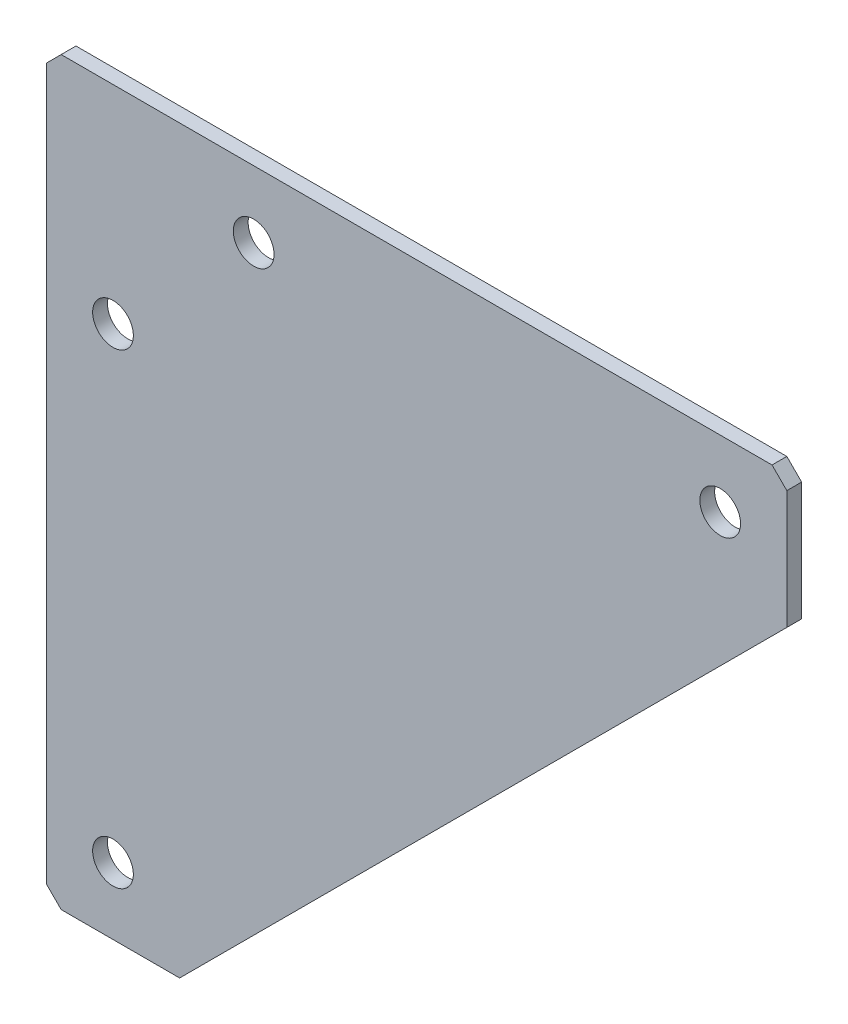
ISO-10303-21;
HEADER;
FILE_DESCRIPTION(('STEP AP214'),'2;1');
FILE_NAME('part.step','',(''),(''),'','','');
FILE_SCHEMA(('AUTOMOTIVE_DESIGN { 1 0 10303 214 1 1 1 1 }'));
ENDSEC;
DATA;
#1=APPLICATION_CONTEXT('core data for automotive mechanical design processes');
#2=APPLICATION_PROTOCOL_DEFINITION('international standard','automotive_design',2000,#1);
#3=PRODUCT_CONTEXT('',#1,'mechanical');
#4=PRODUCT('Part','Part','',(#3));
#5=PRODUCT_RELATED_PRODUCT_CATEGORY('part','',(#4));
#6=PRODUCT_DEFINITION_FORMATION('','',#4);
#7=PRODUCT_DEFINITION_CONTEXT('part definition',#1,'design');
#8=PRODUCT_DEFINITION('design','',#6,#7);
#9=PRODUCT_DEFINITION_SHAPE('','',#8);
#10=(LENGTH_UNIT() NAMED_UNIT(*) SI_UNIT(.MILLI.,.METRE.));
#11=(NAMED_UNIT(*) PLANE_ANGLE_UNIT() SI_UNIT($,.RADIAN.));
#12=(NAMED_UNIT(*) SI_UNIT($,.STERADIAN.) SOLID_ANGLE_UNIT());
#13=UNCERTAINTY_MEASURE_WITH_UNIT(LENGTH_MEASURE(1.E-05),#10,'distance_accuracy_value','');
#14=(GEOMETRIC_REPRESENTATION_CONTEXT(3) GLOBAL_UNCERTAINTY_ASSIGNED_CONTEXT((#13)) GLOBAL_UNIT_ASSIGNED_CONTEXT((#10,
#11,#12)) REPRESENTATION_CONTEXT('',''));
#15=CARTESIAN_POINT('',(0.,0.,0.));
#16=DIRECTION('',(0.,0.,1.));
#17=DIRECTION('',(1.,0.,0.));
#18=AXIS2_PLACEMENT_3D('',#15,#16,#17);
#19=CARTESIAN_POINT('',(2.,100.,-2.));
#20=DIRECTION('',(-0.707106781186548,0.707106781186547,0.));
#21=DIRECTION('',(-0.707106781186547,-0.707106781186548,0.));
#22=AXIS2_PLACEMENT_3D('',#19,#20,#21);
#23=PLANE('',#22);
#24=DIRECTION('',(-0.707106781186547,-0.707106781186548,0.));
#25=VECTOR('',#24,1.);
#26=CARTESIAN_POINT('',(2.,100.,0.));
#27=LINE('',#26,#25);
#28=CARTESIAN_POINT('',(2.,100.,0.));
#29=VERTEX_POINT('',#28);
#30=CARTESIAN_POINT('',(0.,98.,0.));
#31=VERTEX_POINT('',#30);
#32=EDGE_CURVE('E129',#29,#31,#27,.T.);
#33=ORIENTED_EDGE('',*,*,#32,.F.);
#34=DIRECTION('',(0.,0.,1.));
#35=VECTOR('',#34,1.);
#36=CARTESIAN_POINT('',(2.,100.,-2.));
#37=LINE('',#36,#35);
#38=CARTESIAN_POINT('',(2.,100.,-2.));
#39=VERTEX_POINT('',#38);
#40=EDGE_CURVE('E11',#39,#29,#37,.T.);
#41=ORIENTED_EDGE('',*,*,#40,.F.);
#42=DIRECTION('',(-0.707106781186547,-0.707106781186548,0.));
#43=VECTOR('',#42,1.);
#44=CARTESIAN_POINT('',(2.,100.,-2.));
#45=LINE('',#44,#43);
#46=CARTESIAN_POINT('',(0.,98.,-2.));
#47=VERTEX_POINT('',#46);
#48=EDGE_CURVE('E150',#39,#47,#45,.T.);
#49=ORIENTED_EDGE('',*,*,#48,.T.);
#50=DIRECTION('',(0.,0.,1.));
#51=VECTOR('',#50,1.);
#52=CARTESIAN_POINT('',(0.,98.,-2.));
#53=LINE('',#52,#51);
#54=EDGE_CURVE('E35',#47,#31,#53,.T.);
#55=ORIENTED_EDGE('',*,*,#54,.T.);
#56=EDGE_LOOP('',(#33,#41,#49,#55));
#57=FACE_BOUND('',#56,.T.);
#58=ADVANCED_FACE('F32',(#57),#23,.T.);
#59=CARTESIAN_POINT('',(98.,100.,-2.));
#60=DIRECTION('',(0.,1.,0.));
#61=DIRECTION('',(0.,0.,1.));
#62=AXIS2_PLACEMENT_3D('',#59,#60,#61);
#63=PLANE('',#62);
#64=DIRECTION('',(-1.,0.,0.));
#65=VECTOR('',#64,1.);
#66=CARTESIAN_POINT('',(98.,100.,0.));
#67=LINE('',#66,#65);
#68=CARTESIAN_POINT('',(98.,100.,0.));
#69=VERTEX_POINT('',#68);
#70=EDGE_CURVE('E148',#69,#29,#67,.T.);
#71=ORIENTED_EDGE('',*,*,#70,.F.);
#72=DIRECTION('',(0.,0.,1.));
#73=VECTOR('',#72,1.);
#74=CARTESIAN_POINT('',(98.,100.,-2.));
#75=LINE('',#74,#73);
#76=CARTESIAN_POINT('',(98.,100.,-2.));
#77=VERTEX_POINT('',#76);
#78=EDGE_CURVE('E41',#77,#69,#75,.T.);
#79=ORIENTED_EDGE('',*,*,#78,.F.);
#80=DIRECTION('',(-1.,0.,0.));
#81=VECTOR('',#80,1.);
#82=CARTESIAN_POINT('',(98.,100.,-2.));
#83=LINE('',#82,#81);
#84=EDGE_CURVE('E119',#77,#39,#83,.T.);
#85=ORIENTED_EDGE('',*,*,#84,.T.);
#86=ORIENTED_EDGE('',*,*,#40,.T.);
#87=EDGE_LOOP('',(#71,#79,#85,#86));
#88=FACE_BOUND('',#87,.T.);
#89=ADVANCED_FACE('F162',(#88),#63,.T.);
#90=CARTESIAN_POINT('',(100.,98.,-2.));
#91=DIRECTION('',(0.707106781186547,0.707106781186547,0.));
#92=DIRECTION('',(-0.707106781186548,0.707106781186548,0.));
#93=AXIS2_PLACEMENT_3D('',#90,#91,#92);
#94=PLANE('',#93);
#95=DIRECTION('',(-0.707106781186547,0.707106781186547,0.));
#96=VECTOR('',#95,1.);
#97=CARTESIAN_POINT('',(100.,98.,0.));
#98=LINE('',#97,#96);
#99=CARTESIAN_POINT('',(100.,98.,0.));
#100=VERTEX_POINT('',#99);
#101=EDGE_CURVE('E106',#100,#69,#98,.T.);
#102=ORIENTED_EDGE('',*,*,#101,.F.);
#103=DIRECTION('',(0.,0.,1.));
#104=VECTOR('',#103,1.);
#105=CARTESIAN_POINT('',(100.,98.,-2.));
#106=LINE('',#105,#104);
#107=CARTESIAN_POINT('',(100.,98.,-2.));
#108=VERTEX_POINT('',#107);
#109=EDGE_CURVE('E101',#108,#100,#106,.T.);
#110=ORIENTED_EDGE('',*,*,#109,.F.);
#111=DIRECTION('',(-0.707106781186547,0.707106781186547,0.));
#112=VECTOR('',#111,1.);
#113=CARTESIAN_POINT('',(100.,98.,-2.));
#114=LINE('',#113,#112);
#115=EDGE_CURVE('E104',#108,#77,#114,.T.);
#116=ORIENTED_EDGE('',*,*,#115,.T.);
#117=ORIENTED_EDGE('',*,*,#78,.T.);
#118=EDGE_LOOP('',(#102,#110,#116,#117));
#119=FACE_BOUND('',#118,.T.);
#120=ADVANCED_FACE('F103',(#119),#94,.T.);
#121=CARTESIAN_POINT('',(100.,82.,-2.));
#122=DIRECTION('',(1.,0.,0.));
#123=DIRECTION('',(0.,0.,-1.));
#124=AXIS2_PLACEMENT_3D('',#121,#122,#123);
#125=PLANE('',#124);
#126=DIRECTION('',(0.,1.,0.));
#127=VECTOR('',#126,1.);
#128=CARTESIAN_POINT('',(100.,82.,0.));
#129=LINE('',#128,#127);
#130=CARTESIAN_POINT('',(100.,82.,0.));
#131=VERTEX_POINT('',#130);
#132=EDGE_CURVE('E145',#131,#100,#129,.T.);
#133=ORIENTED_EDGE('',*,*,#132,.F.);
#134=DIRECTION('',(0.,0.,1.));
#135=VECTOR('',#134,1.);
#136=CARTESIAN_POINT('',(100.,82.,-2.));
#137=LINE('',#136,#135);
#138=CARTESIAN_POINT('',(100.,82.,-2.));
#139=VERTEX_POINT('',#138);
#140=EDGE_CURVE('E111',#139,#131,#137,.T.);
#141=ORIENTED_EDGE('',*,*,#140,.F.);
#142=DIRECTION('',(0.,1.,0.));
#143=VECTOR('',#142,1.);
#144=CARTESIAN_POINT('',(100.,82.,-2.));
#145=LINE('',#144,#143);
#146=EDGE_CURVE('E117',#139,#108,#145,.T.);
#147=ORIENTED_EDGE('',*,*,#146,.T.);
#148=ORIENTED_EDGE('',*,*,#109,.T.);
#149=EDGE_LOOP('',(#133,#141,#147,#148));
#150=FACE_BOUND('',#149,.T.);
#151=ADVANCED_FACE('F121',(#150),#125,.T.);
#152=CARTESIAN_POINT('',(18.,0.,-2.));
#153=DIRECTION('',(0.707106781186547,-0.707106781186547,0.));
#154=DIRECTION('',(0.707106781186548,0.707106781186548,0.));
#155=AXIS2_PLACEMENT_3D('',#152,#153,#154);
#156=PLANE('',#155);
#157=DIRECTION('',(0.707106781186548,0.707106781186548,0.));
#158=VECTOR('',#157,1.);
#159=CARTESIAN_POINT('',(18.,0.,0.));
#160=LINE('',#159,#158);
#161=CARTESIAN_POINT('',(18.,0.,0.));
#162=VERTEX_POINT('',#161);
#163=EDGE_CURVE('E142',#162,#131,#160,.T.);
#164=ORIENTED_EDGE('',*,*,#163,.F.);
#165=DIRECTION('',(0.,0.,1.));
#166=VECTOR('',#165,1.);
#167=CARTESIAN_POINT('',(18.,0.,-2.));
#168=LINE('',#167,#166);
#169=CARTESIAN_POINT('',(18.,0.,-2.));
#170=VERTEX_POINT('',#169);
#171=EDGE_CURVE('E154',#170,#162,#168,.T.);
#172=ORIENTED_EDGE('',*,*,#171,.F.);
#173=DIRECTION('',(0.707106781186548,0.707106781186548,0.));
#174=VECTOR('',#173,1.);
#175=CARTESIAN_POINT('',(18.,0.,-2.));
#176=LINE('',#175,#174);
#177=EDGE_CURVE('E122',#170,#139,#176,.T.);
#178=ORIENTED_EDGE('',*,*,#177,.T.);
#179=ORIENTED_EDGE('',*,*,#140,.T.);
#180=EDGE_LOOP('',(#164,#172,#178,#179));
#181=FACE_BOUND('',#180,.T.);
#182=ADVANCED_FACE('F175',(#181),#156,.T.);
#183=CARTESIAN_POINT('',(2.,0.,-2.));
#184=DIRECTION('',(0.,-1.,0.));
#185=DIRECTION('',(0.,0.,-1.));
#186=AXIS2_PLACEMENT_3D('',#183,#184,#185);
#187=PLANE('',#186);
#188=DIRECTION('',(1.,0.,0.));
#189=VECTOR('',#188,1.);
#190=CARTESIAN_POINT('',(2.,0.,0.));
#191=LINE('',#190,#189);
#192=CARTESIAN_POINT('',(2.,0.,0.));
#193=VERTEX_POINT('',#192);
#194=EDGE_CURVE('E139',#193,#162,#191,.T.);
#195=ORIENTED_EDGE('',*,*,#194,.F.);
#196=DIRECTION('',(0.,0.,1.));
#197=VECTOR('',#196,1.);
#198=CARTESIAN_POINT('',(2.,0.,-2.));
#199=LINE('',#198,#197);
#200=CARTESIAN_POINT('',(2.,0.,-2.));
#201=VERTEX_POINT('',#200);
#202=EDGE_CURVE('E156',#201,#193,#199,.T.);
#203=ORIENTED_EDGE('',*,*,#202,.F.);
#204=DIRECTION('',(1.,0.,0.));
#205=VECTOR('',#204,1.);
#206=CARTESIAN_POINT('',(2.,0.,-2.));
#207=LINE('',#206,#205);
#208=EDGE_CURVE('E124',#201,#170,#207,.T.);
#209=ORIENTED_EDGE('',*,*,#208,.T.);
#210=ORIENTED_EDGE('',*,*,#171,.T.);
#211=EDGE_LOOP('',(#195,#203,#209,#210));
#212=FACE_BOUND('',#211,.T.);
#213=ADVANCED_FACE('F178',(#212),#187,.T.);
#214=CARTESIAN_POINT('',(0.,2.,-2.));
#215=DIRECTION('',(-0.707106781186547,-0.707106781186547,0.));
#216=DIRECTION('',(0.707106781186548,-0.707106781186548,0.));
#217=AXIS2_PLACEMENT_3D('',#214,#215,#216);
#218=PLANE('',#217);
#219=DIRECTION('',(0.707106781186548,-0.707106781186548,0.));
#220=VECTOR('',#219,1.);
#221=CARTESIAN_POINT('',(0.,2.,0.));
#222=LINE('',#221,#220);
#223=CARTESIAN_POINT('',(0.,2.,0.));
#224=VERTEX_POINT('',#223);
#225=EDGE_CURVE('E136',#224,#193,#222,.T.);
#226=ORIENTED_EDGE('',*,*,#225,.F.);
#227=DIRECTION('',(0.,0.,1.));
#228=VECTOR('',#227,1.);
#229=CARTESIAN_POINT('',(0.,2.,-2.));
#230=LINE('',#229,#228);
#231=CARTESIAN_POINT('',(0.,2.,-2.));
#232=VERTEX_POINT('',#231);
#233=EDGE_CURVE('E157',#232,#224,#230,.T.);
#234=ORIENTED_EDGE('',*,*,#233,.F.);
#235=DIRECTION('',(0.707106781186548,-0.707106781186548,0.));
#236=VECTOR('',#235,1.);
#237=CARTESIAN_POINT('',(0.,2.,-2.));
#238=LINE('',#237,#236);
#239=EDGE_CURVE('E244',#232,#201,#238,.T.);
#240=ORIENTED_EDGE('',*,*,#239,.T.);
#241=ORIENTED_EDGE('',*,*,#202,.T.);
#242=EDGE_LOOP('',(#226,#234,#240,#241));
#243=FACE_BOUND('',#242,.T.);
#244=ADVANCED_FACE('F182',(#243),#218,.T.);
#245=CARTESIAN_POINT('',(0.,98.,-2.));
#246=DIRECTION('',(-1.,0.,0.));
#247=DIRECTION('',(0.,0.,1.));
#248=AXIS2_PLACEMENT_3D('',#245,#246,#247);
#249=PLANE('',#248);
#250=DIRECTION('',(0.,-1.,0.));
#251=VECTOR('',#250,1.);
#252=CARTESIAN_POINT('',(0.,98.,0.));
#253=LINE('',#252,#251);
#254=EDGE_CURVE('E132',#31,#224,#253,.T.);
#255=ORIENTED_EDGE('',*,*,#254,.F.);
#256=ORIENTED_EDGE('',*,*,#54,.F.);
#257=DIRECTION('',(0.,-1.,0.));
#258=VECTOR('',#257,1.);
#259=CARTESIAN_POINT('',(0.,98.,-2.));
#260=LINE('',#259,#258);
#261=EDGE_CURVE('E242',#47,#232,#260,.T.);
#262=ORIENTED_EDGE('',*,*,#261,.T.);
#263=ORIENTED_EDGE('',*,*,#233,.T.);
#264=EDGE_LOOP('',(#255,#256,#262,#263));
#265=FACE_BOUND('',#264,.T.);
#266=ADVANCED_FACE('F159',(#265),#249,.T.);
#267=CARTESIAN_POINT('',(0.,0.,-2.));
#268=DIRECTION('',(0.,0.,1.));
#269=DIRECTION('',(1.,0.,0.));
#270=AXIS2_PLACEMENT_3D('',#267,#268,#269);
#271=PLANE('',#270);
#272=CARTESIAN_POINT('',(9.,72.,-2.));
#273=DIRECTION('',(0.,0.,1.));
#274=DIRECTION('',(1.,0.,0.));
#275=AXIS2_PLACEMENT_3D('',#272,#273,#274);
#276=CIRCLE('',#275,2.75);
#277=CARTESIAN_POINT('',(11.75,72.,-2.));
#278=VERTEX_POINT('',#277);
#279=EDGE_CURVE('E217',#278,#278,#276,.T.);
#280=ORIENTED_EDGE('',*,*,#279,.T.);
#281=EDGE_LOOP('',(#280));
#282=FACE_BOUND('',#281,.T.);
#283=CARTESIAN_POINT('',(9.,9.,-2.));
#284=DIRECTION('',(0.,0.,1.));
#285=DIRECTION('',(1.,0.,0.));
#286=AXIS2_PLACEMENT_3D('',#283,#284,#285);
#287=CIRCLE('',#286,2.75);
#288=CARTESIAN_POINT('',(11.75,9.,-2.));
#289=VERTEX_POINT('',#288);
#290=EDGE_CURVE('E225',#289,#289,#287,.T.);
#291=ORIENTED_EDGE('',*,*,#290,.T.);
#292=EDGE_LOOP('',(#291));
#293=FACE_BOUND('',#292,.T.);
#294=CARTESIAN_POINT('',(28.,91.,-2.));
#295=DIRECTION('',(0.,0.,1.));
#296=DIRECTION('',(1.,0.,0.));
#297=AXIS2_PLACEMENT_3D('',#294,#295,#296);
#298=CIRCLE('',#297,2.75);
#299=CARTESIAN_POINT('',(30.75,91.,-2.));
#300=VERTEX_POINT('',#299);
#301=EDGE_CURVE('E231',#300,#300,#298,.T.);
#302=ORIENTED_EDGE('',*,*,#301,.T.);
#303=EDGE_LOOP('',(#302));
#304=FACE_BOUND('',#303,.T.);
#305=CARTESIAN_POINT('',(91.,91.,-2.));
#306=DIRECTION('',(0.,0.,1.));
#307=DIRECTION('',(1.,0.,0.));
#308=AXIS2_PLACEMENT_3D('',#305,#306,#307);
#309=CIRCLE('',#308,2.75);
#310=CARTESIAN_POINT('',(93.75,91.,-2.));
#311=VERTEX_POINT('',#310);
#312=EDGE_CURVE('E133',#311,#311,#309,.T.);
#313=ORIENTED_EDGE('',*,*,#312,.T.);
#314=EDGE_LOOP('',(#313));
#315=FACE_BOUND('',#314,.T.);
#316=ORIENTED_EDGE('',*,*,#48,.F.);
#317=ORIENTED_EDGE('',*,*,#84,.F.);
#318=ORIENTED_EDGE('',*,*,#115,.F.);
#319=ORIENTED_EDGE('',*,*,#146,.F.);
#320=ORIENTED_EDGE('',*,*,#177,.F.);
#321=ORIENTED_EDGE('',*,*,#208,.F.);
#322=ORIENTED_EDGE('',*,*,#239,.F.);
#323=ORIENTED_EDGE('',*,*,#261,.F.);
#324=EDGE_LOOP('',(#316,#317,#318,#319,#320,#321,#322,#323));
#325=FACE_BOUND('',#324,.T.);
#326=ADVANCED_FACE('F115',(#282,#293,#304,#315,#325),#271,.F.);
#327=CARTESIAN_POINT('',(0.,0.,0.));
#328=DIRECTION('',(0.,0.,1.));
#329=DIRECTION('',(1.,0.,0.));
#330=AXIS2_PLACEMENT_3D('',#327,#328,#329);
#331=PLANE('',#330);
#332=CARTESIAN_POINT('',(9.,72.,0.));
#333=DIRECTION('',(0.,0.,1.));
#334=DIRECTION('',(1.,0.,0.));
#335=AXIS2_PLACEMENT_3D('',#332,#333,#334);
#336=CIRCLE('',#335,2.75);
#337=CARTESIAN_POINT('',(11.75,72.,0.));
#338=VERTEX_POINT('',#337);
#339=EDGE_CURVE('E220',#338,#338,#336,.T.);
#340=ORIENTED_EDGE('',*,*,#339,.F.);
#341=EDGE_LOOP('',(#340));
#342=FACE_BOUND('',#341,.T.);
#343=CARTESIAN_POINT('',(9.,9.,0.));
#344=DIRECTION('',(0.,0.,1.));
#345=DIRECTION('',(1.,0.,0.));
#346=AXIS2_PLACEMENT_3D('',#343,#344,#345);
#347=CIRCLE('',#346,2.75);
#348=CARTESIAN_POINT('',(11.75,9.,0.));
#349=VERTEX_POINT('',#348);
#350=EDGE_CURVE('E222',#349,#349,#347,.T.);
#351=ORIENTED_EDGE('',*,*,#350,.F.);
#352=EDGE_LOOP('',(#351));
#353=FACE_BOUND('',#352,.T.);
#354=CARTESIAN_POINT('',(28.,91.,0.));
#355=DIRECTION('',(0.,0.,1.));
#356=DIRECTION('',(1.,0.,0.));
#357=AXIS2_PLACEMENT_3D('',#354,#355,#356);
#358=CIRCLE('',#357,2.75);
#359=CARTESIAN_POINT('',(30.75,91.,0.));
#360=VERTEX_POINT('',#359);
#361=EDGE_CURVE('E228',#360,#360,#358,.T.);
#362=ORIENTED_EDGE('',*,*,#361,.F.);
#363=EDGE_LOOP('',(#362));
#364=FACE_BOUND('',#363,.T.);
#365=CARTESIAN_POINT('',(91.,91.,0.));
#366=DIRECTION('',(0.,0.,1.));
#367=DIRECTION('',(1.,0.,0.));
#368=AXIS2_PLACEMENT_3D('',#365,#366,#367);
#369=CIRCLE('',#368,2.75);
#370=CARTESIAN_POINT('',(93.75,91.,0.));
#371=VERTEX_POINT('',#370);
#372=EDGE_CURVE('E234',#371,#371,#369,.T.);
#373=ORIENTED_EDGE('',*,*,#372,.F.);
#374=EDGE_LOOP('',(#373));
#375=FACE_BOUND('',#374,.T.);
#376=ORIENTED_EDGE('',*,*,#32,.T.);
#377=ORIENTED_EDGE('',*,*,#254,.T.);
#378=ORIENTED_EDGE('',*,*,#225,.T.);
#379=ORIENTED_EDGE('',*,*,#194,.T.);
#380=ORIENTED_EDGE('',*,*,#163,.T.);
#381=ORIENTED_EDGE('',*,*,#132,.T.);
#382=ORIENTED_EDGE('',*,*,#101,.T.);
#383=ORIENTED_EDGE('',*,*,#70,.T.);
#384=EDGE_LOOP('',(#376,#377,#378,#379,#380,#381,#382,#383));
#385=FACE_BOUND('',#384,.T.);
#386=ADVANCED_FACE('F161',(#342,#353,#364,#375,#385),#331,.T.);
#387=CARTESIAN_POINT('',(91.,91.,-2.));
#388=DIRECTION('',(0.,0.,1.));
#389=DIRECTION('',(1.,0.,0.));
#390=AXIS2_PLACEMENT_3D('',#387,#388,#389);
#391=CYLINDRICAL_SURFACE('',#390,2.75);
#392=ORIENTED_EDGE('',*,*,#312,.F.);
#393=EDGE_LOOP('',(#392));
#394=FACE_BOUND('',#393,.T.);
#395=ORIENTED_EDGE('',*,*,#372,.T.);
#396=EDGE_LOOP('',(#395));
#397=FACE_BOUND('',#396,.T.);
#398=ADVANCED_FACE('F194',(#394,#397),#391,.F.);
#399=CARTESIAN_POINT('',(28.,91.,-2.));
#400=DIRECTION('',(0.,0.,1.));
#401=DIRECTION('',(1.,0.,0.));
#402=AXIS2_PLACEMENT_3D('',#399,#400,#401);
#403=CYLINDRICAL_SURFACE('',#402,2.75);
#404=ORIENTED_EDGE('',*,*,#301,.F.);
#405=EDGE_LOOP('',(#404));
#406=FACE_BOUND('',#405,.T.);
#407=ORIENTED_EDGE('',*,*,#361,.T.);
#408=EDGE_LOOP('',(#407));
#409=FACE_BOUND('',#408,.T.);
#410=ADVANCED_FACE('F201',(#406,#409),#403,.F.);
#411=CARTESIAN_POINT('',(9.,9.,-2.));
#412=DIRECTION('',(0.,0.,1.));
#413=DIRECTION('',(1.,0.,0.));
#414=AXIS2_PLACEMENT_3D('',#411,#412,#413);
#415=CYLINDRICAL_SURFACE('',#414,2.75);
#416=ORIENTED_EDGE('',*,*,#290,.F.);
#417=EDGE_LOOP('',(#416));
#418=FACE_BOUND('',#417,.T.);
#419=ORIENTED_EDGE('',*,*,#350,.T.);
#420=EDGE_LOOP('',(#419));
#421=FACE_BOUND('',#420,.T.);
#422=ADVANCED_FACE('F205',(#418,#421),#415,.F.);
#423=CARTESIAN_POINT('',(9.,72.,-2.));
#424=DIRECTION('',(0.,0.,1.));
#425=DIRECTION('',(1.,0.,0.));
#426=AXIS2_PLACEMENT_3D('',#423,#424,#425);
#427=CYLINDRICAL_SURFACE('',#426,2.75);
#428=ORIENTED_EDGE('',*,*,#279,.F.);
#429=EDGE_LOOP('',(#428));
#430=FACE_BOUND('',#429,.T.);
#431=ORIENTED_EDGE('',*,*,#339,.T.);
#432=EDGE_LOOP('',(#431));
#433=FACE_BOUND('',#432,.T.);
#434=ADVANCED_FACE('F209',(#430,#433),#427,.F.);
#435=CLOSED_SHELL('',(#58,#89,#120,#151,#182,#213,#244,#266,#326,#386,#398,#410,#422,#434));
#436=MANIFOLD_SOLID_BREP('B2',#435);
#437=ADVANCED_BREP_SHAPE_REPRESENTATION('',(#18,#436),#14);
#438=SHAPE_DEFINITION_REPRESENTATION(#9,#437);
ENDSEC;
END-ISO-10303-21;
